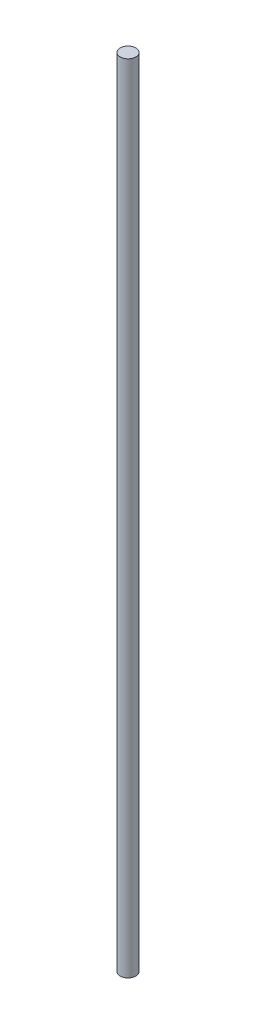
ISO-10303-21;
HEADER;
FILE_DESCRIPTION(('STEP AP214'),'2;1');
FILE_NAME('part.step','',(''),(''),'','','');
FILE_SCHEMA(('AUTOMOTIVE_DESIGN { 1 0 10303 214 1 1 1 1 }'));
ENDSEC;
DATA;
#1=APPLICATION_CONTEXT('core data for automotive mechanical design processes');
#2=APPLICATION_PROTOCOL_DEFINITION('international standard','automotive_design',2000,#1);
#3=PRODUCT_CONTEXT('',#1,'mechanical');
#4=PRODUCT('Part','Part','',(#3));
#5=PRODUCT_RELATED_PRODUCT_CATEGORY('part','',(#4));
#6=PRODUCT_DEFINITION_FORMATION('','',#4);
#7=PRODUCT_DEFINITION_CONTEXT('part definition',#1,'design');
#8=PRODUCT_DEFINITION('design','',#6,#7);
#9=PRODUCT_DEFINITION_SHAPE('','',#8);
#10=(LENGTH_UNIT() NAMED_UNIT(*) SI_UNIT(.MILLI.,.METRE.));
#11=(NAMED_UNIT(*) PLANE_ANGLE_UNIT() SI_UNIT($,.RADIAN.));
#12=(NAMED_UNIT(*) SI_UNIT($,.STERADIAN.) SOLID_ANGLE_UNIT());
#13=UNCERTAINTY_MEASURE_WITH_UNIT(LENGTH_MEASURE(1.E-05),#10,'distance_accuracy_value','');
#14=(GEOMETRIC_REPRESENTATION_CONTEXT(3) GLOBAL_UNCERTAINTY_ASSIGNED_CONTEXT((#13)) GLOBAL_UNIT_ASSIGNED_CONTEXT((#10,
#11,#12)) REPRESENTATION_CONTEXT('',''));
#15=CARTESIAN_POINT('',(0.,0.,0.));
#16=DIRECTION('',(0.,0.,1.));
#17=DIRECTION('',(1.,0.,0.));
#18=AXIS2_PLACEMENT_3D('',#15,#16,#17);
#19=CARTESIAN_POINT('',(0.,406.,0.));
#20=DIRECTION('',(0.,-1.,0.));
#21=DIRECTION('',(0.,0.,-1.));
#22=AXIS2_PLACEMENT_3D('',#19,#20,#21);
#23=CYLINDRICAL_SURFACE('',#22,4.);
#24=CARTESIAN_POINT('',(0.,406.,0.));
#25=DIRECTION('',(0.,1.,0.));
#26=DIRECTION('',(0.,0.,1.));
#27=AXIS2_PLACEMENT_3D('',#24,#25,#26);
#28=CIRCLE('',#27,4.);
#29=CARTESIAN_POINT('',(0.,406.,4.));
#30=VERTEX_POINT('',#29);
#31=EDGE_CURVE('E10',#30,#30,#28,.T.);
#32=ORIENTED_EDGE('',*,*,#31,.F.);
#33=EDGE_LOOP('',(#32));
#34=FACE_BOUND('',#33,.T.);
#35=CARTESIAN_POINT('',(0.,0.,0.));
#36=DIRECTION('',(0.,1.,0.));
#37=DIRECTION('',(0.,0.,1.));
#38=AXIS2_PLACEMENT_3D('',#35,#36,#37);
#39=CIRCLE('',#38,4.);
#40=CARTESIAN_POINT('',(0.,0.,4.));
#41=VERTEX_POINT('',#40);
#42=EDGE_CURVE('E33',#41,#41,#39,.T.);
#43=ORIENTED_EDGE('',*,*,#42,.T.);
#44=EDGE_LOOP('',(#43));
#45=FACE_BOUND('',#44,.T.);
#46=ADVANCED_FACE('F30',(#34,#45),#23,.T.);
#47=CARTESIAN_POINT('',(0.,406.,0.));
#48=DIRECTION('',(0.,1.,0.));
#49=DIRECTION('',(0.,0.,1.));
#50=AXIS2_PLACEMENT_3D('',#47,#48,#49);
#51=PLANE('',#50);
#52=ORIENTED_EDGE('',*,*,#31,.T.);
#53=EDGE_LOOP('',(#52));
#54=FACE_BOUND('',#53,.T.);
#55=ADVANCED_FACE('F45',(#54),#51,.T.);
#56=CARTESIAN_POINT('',(0.,0.,0.));
#57=DIRECTION('',(0.,1.,0.));
#58=DIRECTION('',(0.,0.,1.));
#59=AXIS2_PLACEMENT_3D('',#56,#57,#58);
#60=PLANE('',#59);
#61=ORIENTED_EDGE('',*,*,#42,.F.);
#62=EDGE_LOOP('',(#61));
#63=FACE_BOUND('',#62,.T.);
#64=ADVANCED_FACE('F43',(#63),#60,.F.);
#65=CLOSED_SHELL('',(#46,#55,#64));
#66=MANIFOLD_SOLID_BREP('B2',#65);
#67=ADVANCED_BREP_SHAPE_REPRESENTATION('',(#18,#66),#14);
#68=SHAPE_DEFINITION_REPRESENTATION(#9,#67);
ENDSEC;
END-ISO-10303-21;
